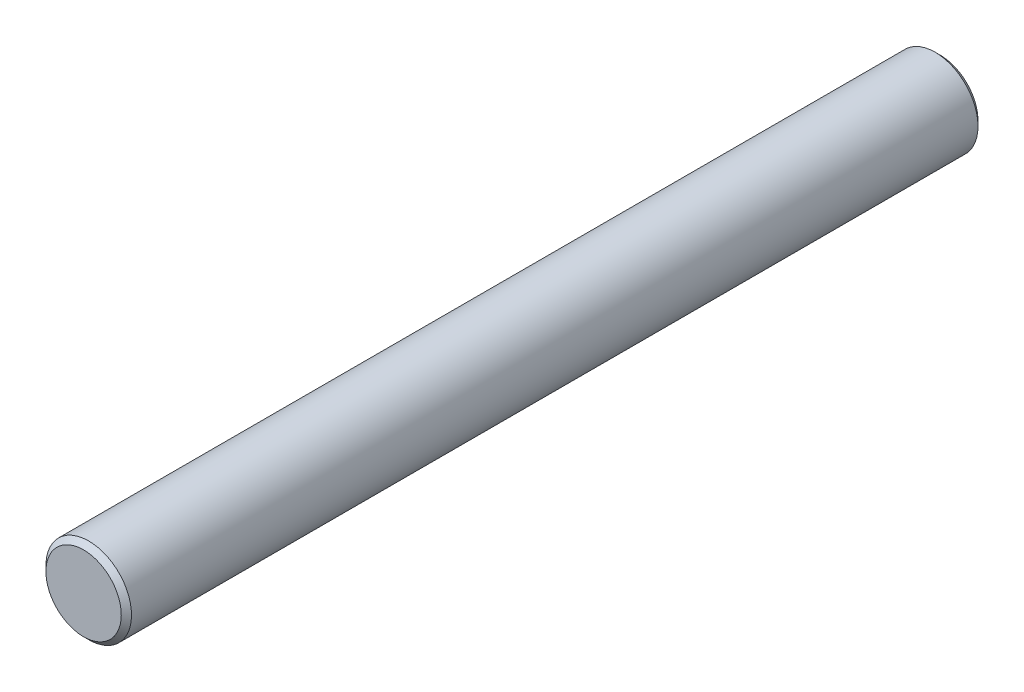
ISO-10303-21;
HEADER;
FILE_DESCRIPTION(('STEP AP214'),'2;1');
FILE_NAME('part.step','',(''),(''),'','','');
FILE_SCHEMA(('AUTOMOTIVE_DESIGN { 1 0 10303 214 1 1 1 1 }'));
ENDSEC;
DATA;
#1=APPLICATION_CONTEXT('core data for automotive mechanical design processes');
#2=APPLICATION_PROTOCOL_DEFINITION('international standard','automotive_design',2000,#1);
#3=PRODUCT_CONTEXT('',#1,'mechanical');
#4=PRODUCT('Part','Part','',(#3));
#5=PRODUCT_RELATED_PRODUCT_CATEGORY('part','',(#4));
#6=PRODUCT_DEFINITION_FORMATION('','',#4);
#7=PRODUCT_DEFINITION_CONTEXT('part definition',#1,'design');
#8=PRODUCT_DEFINITION('design','',#6,#7);
#9=PRODUCT_DEFINITION_SHAPE('','',#8);
#10=(LENGTH_UNIT() NAMED_UNIT(*) SI_UNIT(.MILLI.,.METRE.));
#11=(NAMED_UNIT(*) PLANE_ANGLE_UNIT() SI_UNIT($,.RADIAN.));
#12=(NAMED_UNIT(*) SI_UNIT($,.STERADIAN.) SOLID_ANGLE_UNIT());
#13=UNCERTAINTY_MEASURE_WITH_UNIT(LENGTH_MEASURE(1.E-05),#10,'distance_accuracy_value','');
#14=(GEOMETRIC_REPRESENTATION_CONTEXT(3) GLOBAL_UNCERTAINTY_ASSIGNED_CONTEXT((#13)) GLOBAL_UNIT_ASSIGNED_CONTEXT((#10,
#11,#12)) REPRESENTATION_CONTEXT('',''));
#15=CARTESIAN_POINT('',(0.,0.,0.));
#16=DIRECTION('',(0.,0.,1.));
#17=DIRECTION('',(1.,0.,0.));
#18=AXIS2_PLACEMENT_3D('',#15,#16,#17);
#19=CARTESIAN_POINT('',(0.,0.,-62.81));
#20=DIRECTION('',(0.,0.,1.));
#21=DIRECTION('',(1.,0.,0.));
#22=AXIS2_PLACEMENT_3D('',#19,#20,#21);
#23=CYLINDRICAL_SURFACE('',#22,3.175);
#24=CARTESIAN_POINT('',(0.,0.,-62.81));
#25=DIRECTION('',(0.,0.,-1.));
#26=DIRECTION('',(-1.,0.,0.));
#27=AXIS2_PLACEMENT_3D('',#24,#25,#26);
#28=CIRCLE('',#27,3.175);
#29=CARTESIAN_POINT('',(-3.175,0.,-62.81));
#30=VERTEX_POINT('',#29);
#31=EDGE_CURVE('E45',#30,#30,#28,.T.);
#32=ORIENTED_EDGE('',*,*,#31,.F.);
#33=EDGE_LOOP('',(#32));
#34=FACE_BOUND('',#33,.T.);
#35=CARTESIAN_POINT('',(0.,0.,0.));
#36=DIRECTION('',(0.,0.,1.));
#37=DIRECTION('',(1.,0.,0.));
#38=AXIS2_PLACEMENT_3D('',#35,#36,#37);
#39=CIRCLE('',#38,3.175);
#40=CARTESIAN_POINT('',(3.175,0.,0.));
#41=VERTEX_POINT('',#40);
#42=EDGE_CURVE('E10',#41,#41,#39,.T.);
#43=ORIENTED_EDGE('',*,*,#42,.F.);
#44=EDGE_LOOP('',(#43));
#45=FACE_BOUND('',#44,.T.);
#46=ADVANCED_FACE('F31',(#34,#45),#23,.T.);
#47=CARTESIAN_POINT('',(0.,0.,0.));
#48=DIRECTION('',(0.,0.,-1.));
#49=DIRECTION('',(1.,0.,0.));
#50=AXIS2_PLACEMENT_3D('',#47,#48,#49);
#51=CONICAL_SURFACE('',#50,3.175,0.78539816339745);
#52=CARTESIAN_POINT('',(0.,0.,0.38));
#53=DIRECTION('',(0.,0.,1.));
#54=DIRECTION('',(1.,0.,0.));
#55=AXIS2_PLACEMENT_3D('',#52,#53,#54);
#56=CIRCLE('',#55,2.795);
#57=CARTESIAN_POINT('',(2.795,0.,0.38));
#58=VERTEX_POINT('',#57);
#59=EDGE_CURVE('E37',#58,#58,#56,.T.);
#60=ORIENTED_EDGE('',*,*,#59,.F.);
#61=EDGE_LOOP('',(#60));
#62=FACE_BOUND('',#61,.T.);
#63=ORIENTED_EDGE('',*,*,#42,.T.);
#64=EDGE_LOOP('',(#63));
#65=FACE_BOUND('',#64,.T.);
#66=ADVANCED_FACE('F55',(#62,#65),#51,.T.);
#67=CARTESIAN_POINT('',(0.,0.,0.38));
#68=DIRECTION('',(0.,0.,1.));
#69=DIRECTION('',(1.,0.,0.));
#70=AXIS2_PLACEMENT_3D('',#67,#68,#69);
#71=PLANE('',#70);
#72=ORIENTED_EDGE('',*,*,#59,.T.);
#73=EDGE_LOOP('',(#72));
#74=FACE_BOUND('',#73,.T.);
#75=ADVANCED_FACE('F59',(#74),#71,.T.);
#76=CARTESIAN_POINT('',(0.,0.,-62.81));
#77=DIRECTION('',(0.,0.,1.));
#78=DIRECTION('',(-1.,0.,0.));
#79=AXIS2_PLACEMENT_3D('',#76,#77,#78);
#80=CONICAL_SURFACE('',#79,3.175,0.78539816339745);
#81=CARTESIAN_POINT('',(0.,0.,-63.19));
#82=DIRECTION('',(0.,0.,-1.));
#83=DIRECTION('',(-1.,0.,0.));
#84=AXIS2_PLACEMENT_3D('',#81,#82,#83);
#85=CIRCLE('',#84,2.79499999999999);
#86=CARTESIAN_POINT('',(-2.79499999999999,0.,-63.19));
#87=VERTEX_POINT('',#86);
#88=EDGE_CURVE('E41',#87,#87,#85,.T.);
#89=ORIENTED_EDGE('',*,*,#88,.F.);
#90=EDGE_LOOP('',(#89));
#91=FACE_BOUND('',#90,.T.);
#92=ORIENTED_EDGE('',*,*,#31,.T.);
#93=EDGE_LOOP('',(#92));
#94=FACE_BOUND('',#93,.T.);
#95=ADVANCED_FACE('F51',(#91,#94),#80,.T.);
#96=CARTESIAN_POINT('',(0.,0.,-63.19));
#97=DIRECTION('',(0.,0.,-1.));
#98=DIRECTION('',(-1.,0.,0.));
#99=AXIS2_PLACEMENT_3D('',#96,#97,#98);
#100=PLANE('',#99);
#101=ORIENTED_EDGE('',*,*,#88,.T.);
#102=EDGE_LOOP('',(#101));
#103=FACE_BOUND('',#102,.T.);
#104=ADVANCED_FACE('F68',(#103),#100,.T.);
#105=CLOSED_SHELL('',(#46,#66,#75,#95,#104));
#106=MANIFOLD_SOLID_BREP('B2',#105);
#107=ADVANCED_BREP_SHAPE_REPRESENTATION('',(#18,#106),#14);
#108=SHAPE_DEFINITION_REPRESENTATION(#9,#107);
ENDSEC;
END-ISO-10303-21;
